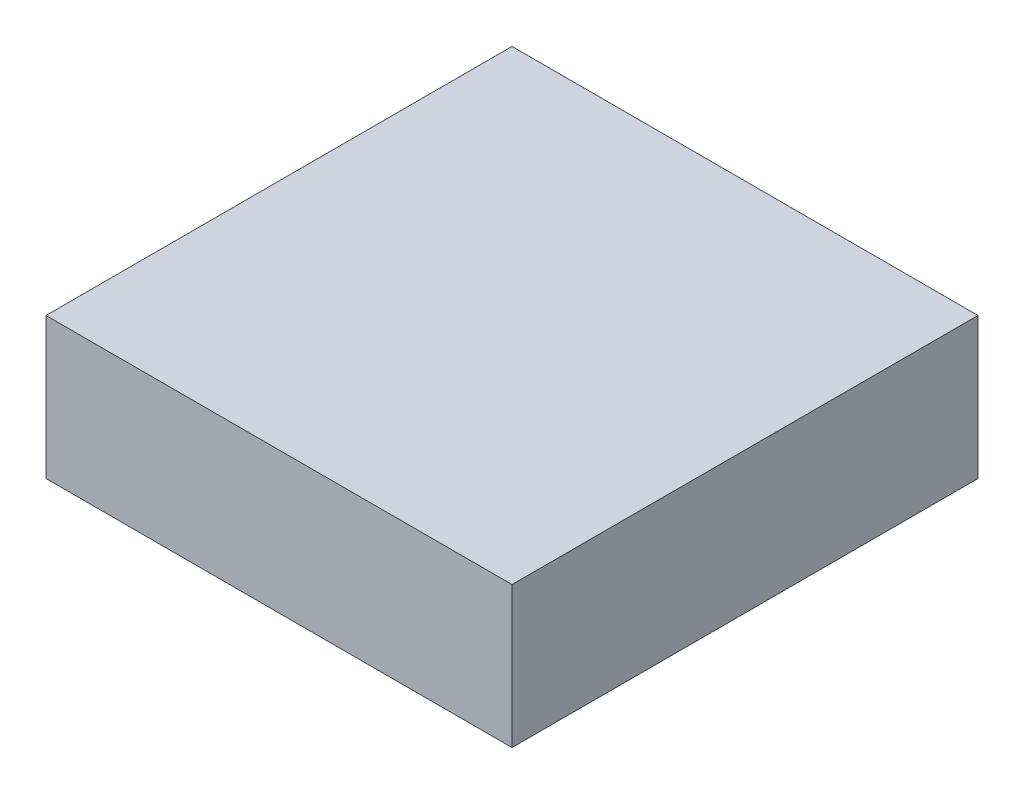
ISO-10303-21;
HEADER;
FILE_DESCRIPTION(('STEP AP214'),'2;1');
FILE_NAME('part.step','',(''),(''),'','','');
FILE_SCHEMA(('AUTOMOTIVE_DESIGN { 1 0 10303 214 1 1 1 1 }'));
ENDSEC;
DATA;
#1=APPLICATION_CONTEXT('core data for automotive mechanical design processes');
#2=APPLICATION_PROTOCOL_DEFINITION('international standard','automotive_design',2000,#1);
#3=PRODUCT_CONTEXT('',#1,'mechanical');
#4=PRODUCT('Part','Part','',(#3));
#5=PRODUCT_RELATED_PRODUCT_CATEGORY('part','',(#4));
#6=PRODUCT_DEFINITION_FORMATION('','',#4);
#7=PRODUCT_DEFINITION_CONTEXT('part definition',#1,'design');
#8=PRODUCT_DEFINITION('design','',#6,#7);
#9=PRODUCT_DEFINITION_SHAPE('','',#8);
#10=(LENGTH_UNIT() NAMED_UNIT(*) SI_UNIT(.MILLI.,.METRE.));
#11=(NAMED_UNIT(*) PLANE_ANGLE_UNIT() SI_UNIT($,.RADIAN.));
#12=(NAMED_UNIT(*) SI_UNIT($,.STERADIAN.) SOLID_ANGLE_UNIT());
#13=UNCERTAINTY_MEASURE_WITH_UNIT(LENGTH_MEASURE(1.E-05),#10,'distance_accuracy_value','');
#14=(GEOMETRIC_REPRESENTATION_CONTEXT(3) GLOBAL_UNCERTAINTY_ASSIGNED_CONTEXT((#13)) GLOBAL_UNIT_ASSIGNED_CONTEXT((#10,
#11,#12)) REPRESENTATION_CONTEXT('',''));
#15=CARTESIAN_POINT('',(0.,0.,0.));
#16=DIRECTION('',(0.,0.,1.));
#17=DIRECTION('',(1.,0.,0.));
#18=AXIS2_PLACEMENT_3D('',#15,#16,#17);
#19=CARTESIAN_POINT('',(27.35,-1.85,-18.025));
#20=DIRECTION('',(0.,-1.,0.));
#21=DIRECTION('',(1.,0.,0.));
#22=AXIS2_PLACEMENT_3D('',#19,#20,#21);
#23=PLANE('',#22);
#24=DIRECTION('',(1.,0.,0.));
#25=VECTOR('',#24,1.);
#26=CARTESIAN_POINT('',(29.,-1.85,-14.725));
#27=LINE('',#26,#25);
#28=CARTESIAN_POINT('',(27.35,-1.85,-14.725));
#29=VERTEX_POINT('',#28);
#30=CARTESIAN_POINT('',(30.65,-1.85,-14.725));
#31=VERTEX_POINT('',#30);
#32=EDGE_CURVE('E54',#29,#31,#27,.T.);
#33=ORIENTED_EDGE('',*,*,#32,.F.);
#34=DIRECTION('',(0.,0.,1.));
#35=VECTOR('',#34,1.);
#36=CARTESIAN_POINT('',(27.35,-1.85,-16.375));
#37=LINE('',#36,#35);
#38=CARTESIAN_POINT('',(27.35,-1.85,-18.025));
#39=VERTEX_POINT('',#38);
#40=EDGE_CURVE('E69',#39,#29,#37,.T.);
#41=ORIENTED_EDGE('',*,*,#40,.F.);
#42=DIRECTION('',(-1.,0.,0.));
#43=VECTOR('',#42,1.);
#44=CARTESIAN_POINT('',(29.,-1.85,-18.025));
#45=LINE('',#44,#43);
#46=CARTESIAN_POINT('',(30.65,-1.85,-18.025));
#47=VERTEX_POINT('',#46);
#48=EDGE_CURVE('E21',#47,#39,#45,.T.);
#49=ORIENTED_EDGE('',*,*,#48,.F.);
#50=DIRECTION('',(0.,0.,-1.));
#51=VECTOR('',#50,1.);
#52=CARTESIAN_POINT('',(30.65,-1.85,-16.375));
#53=LINE('',#52,#51);
#54=EDGE_CURVE('E59',#31,#47,#53,.T.);
#55=ORIENTED_EDGE('',*,*,#54,.F.);
#56=EDGE_LOOP('',(#33,#41,#49,#55));
#57=FACE_BOUND('',#56,.T.);
#58=ADVANCED_FACE('F17',(#57),#23,.T.);
#59=CARTESIAN_POINT('',(27.35,-0.85,-18.025));
#60=DIRECTION('',(0.,0.,-1.));
#61=DIRECTION('',(1.,0.,0.));
#62=AXIS2_PLACEMENT_3D('',#59,#60,#61);
#63=PLANE('',#62);
#64=ORIENTED_EDGE('',*,*,#48,.T.);
#65=DIRECTION('',(0.,-1.,0.));
#66=VECTOR('',#65,1.);
#67=CARTESIAN_POINT('',(27.35,-1.35,-18.025));
#68=LINE('',#67,#66);
#69=CARTESIAN_POINT('',(27.35,-0.85,-18.025));
#70=VERTEX_POINT('',#69);
#71=EDGE_CURVE('E80',#70,#39,#68,.T.);
#72=ORIENTED_EDGE('',*,*,#71,.F.);
#73=DIRECTION('',(1.,0.,0.));
#74=VECTOR('',#73,1.);
#75=CARTESIAN_POINT('',(29.,-0.85,-18.025));
#76=LINE('',#75,#74);
#77=CARTESIAN_POINT('',(30.65,-0.85,-18.025));
#78=VERTEX_POINT('',#77);
#79=EDGE_CURVE('E75',#70,#78,#76,.T.);
#80=ORIENTED_EDGE('',*,*,#79,.T.);
#81=DIRECTION('',(0.,1.,0.));
#82=VECTOR('',#81,1.);
#83=CARTESIAN_POINT('',(30.65,-1.35,-18.025));
#84=LINE('',#83,#82);
#85=EDGE_CURVE('E64',#47,#78,#84,.T.);
#86=ORIENTED_EDGE('',*,*,#85,.F.);
#87=EDGE_LOOP('',(#64,#72,#80,#86));
#88=FACE_BOUND('',#87,.T.);
#89=ADVANCED_FACE('F74',(#88),#63,.T.);
#90=CARTESIAN_POINT('',(30.65,-0.85,-18.025));
#91=DIRECTION('',(1.,0.,0.));
#92=DIRECTION('',(0.,0.,1.));
#93=AXIS2_PLACEMENT_3D('',#90,#91,#92);
#94=PLANE('',#93);
#95=ORIENTED_EDGE('',*,*,#54,.T.);
#96=ORIENTED_EDGE('',*,*,#85,.T.);
#97=DIRECTION('',(0.,0.,1.));
#98=VECTOR('',#97,1.);
#99=CARTESIAN_POINT('',(30.65,-0.85,-16.375));
#100=LINE('',#99,#98);
#101=CARTESIAN_POINT('',(30.65,-0.85,-14.725));
#102=VERTEX_POINT('',#101);
#103=EDGE_CURVE('E85',#78,#102,#100,.T.);
#104=ORIENTED_EDGE('',*,*,#103,.T.);
#105=DIRECTION('',(0.,1.,0.));
#106=VECTOR('',#105,1.);
#107=CARTESIAN_POINT('',(30.65,-1.35,-14.725));
#108=LINE('',#107,#106);
#109=EDGE_CURVE('E66',#31,#102,#108,.T.);
#110=ORIENTED_EDGE('',*,*,#109,.F.);
#111=EDGE_LOOP('',(#95,#96,#104,#110));
#112=FACE_BOUND('',#111,.T.);
#113=ADVANCED_FACE('F61',(#112),#94,.T.);
#114=CARTESIAN_POINT('',(30.65,-0.85,-14.725));
#115=DIRECTION('',(0.,0.,1.));
#116=DIRECTION('',(-1.,0.,0.));
#117=AXIS2_PLACEMENT_3D('',#114,#115,#116);
#118=PLANE('',#117);
#119=ORIENTED_EDGE('',*,*,#32,.T.);
#120=ORIENTED_EDGE('',*,*,#109,.T.);
#121=DIRECTION('',(-1.,0.,0.));
#122=VECTOR('',#121,1.);
#123=CARTESIAN_POINT('',(29.,-0.85,-14.725));
#124=LINE('',#123,#122);
#125=CARTESIAN_POINT('',(27.35,-0.85,-14.725));
#126=VERTEX_POINT('',#125);
#127=EDGE_CURVE('E27',#102,#126,#124,.T.);
#128=ORIENTED_EDGE('',*,*,#127,.T.);
#129=DIRECTION('',(0.,1.,0.));
#130=VECTOR('',#129,1.);
#131=CARTESIAN_POINT('',(27.35,-1.35,-14.725));
#132=LINE('',#131,#130);
#133=EDGE_CURVE('E35',#29,#126,#132,.T.);
#134=ORIENTED_EDGE('',*,*,#133,.F.);
#135=EDGE_LOOP('',(#119,#120,#128,#134));
#136=FACE_BOUND('',#135,.T.);
#137=ADVANCED_FACE('F89',(#136),#118,.T.);
#138=CARTESIAN_POINT('',(27.35,-0.85,-14.725));
#139=DIRECTION('',(-1.,0.,0.));
#140=DIRECTION('',(0.,0.,-1.));
#141=AXIS2_PLACEMENT_3D('',#138,#139,#140);
#142=PLANE('',#141);
#143=ORIENTED_EDGE('',*,*,#40,.T.);
#144=ORIENTED_EDGE('',*,*,#133,.T.);
#145=DIRECTION('',(0.,0.,-1.));
#146=VECTOR('',#145,1.);
#147=CARTESIAN_POINT('',(27.35,-0.85,-16.375));
#148=LINE('',#147,#146);
#149=EDGE_CURVE('E11',#126,#70,#148,.T.);
#150=ORIENTED_EDGE('',*,*,#149,.T.);
#151=ORIENTED_EDGE('',*,*,#71,.T.);
#152=EDGE_LOOP('',(#143,#144,#150,#151));
#153=FACE_BOUND('',#152,.T.);
#154=ADVANCED_FACE('F91',(#153),#142,.T.);
#155=CARTESIAN_POINT('',(27.35,-0.85,-18.025));
#156=DIRECTION('',(0.,-1.,0.));
#157=DIRECTION('',(1.,0.,0.));
#158=AXIS2_PLACEMENT_3D('',#155,#156,#157);
#159=PLANE('',#158);
#160=ORIENTED_EDGE('',*,*,#127,.F.);
#161=ORIENTED_EDGE('',*,*,#103,.F.);
#162=ORIENTED_EDGE('',*,*,#79,.F.);
#163=ORIENTED_EDGE('',*,*,#149,.F.);
#164=EDGE_LOOP('',(#160,#161,#162,#163));
#165=FACE_BOUND('',#164,.T.);
#166=ADVANCED_FACE('F19',(#165),#159,.F.);
#167=CLOSED_SHELL('',(#58,#89,#113,#137,#154,#166));
#168=MANIFOLD_SOLID_BREP('B1',#167);
#169=ADVANCED_BREP_SHAPE_REPRESENTATION('',(#18,#168),#14);
#170=SHAPE_DEFINITION_REPRESENTATION(#9,#169);
ENDSEC;
END-ISO-10303-21;
